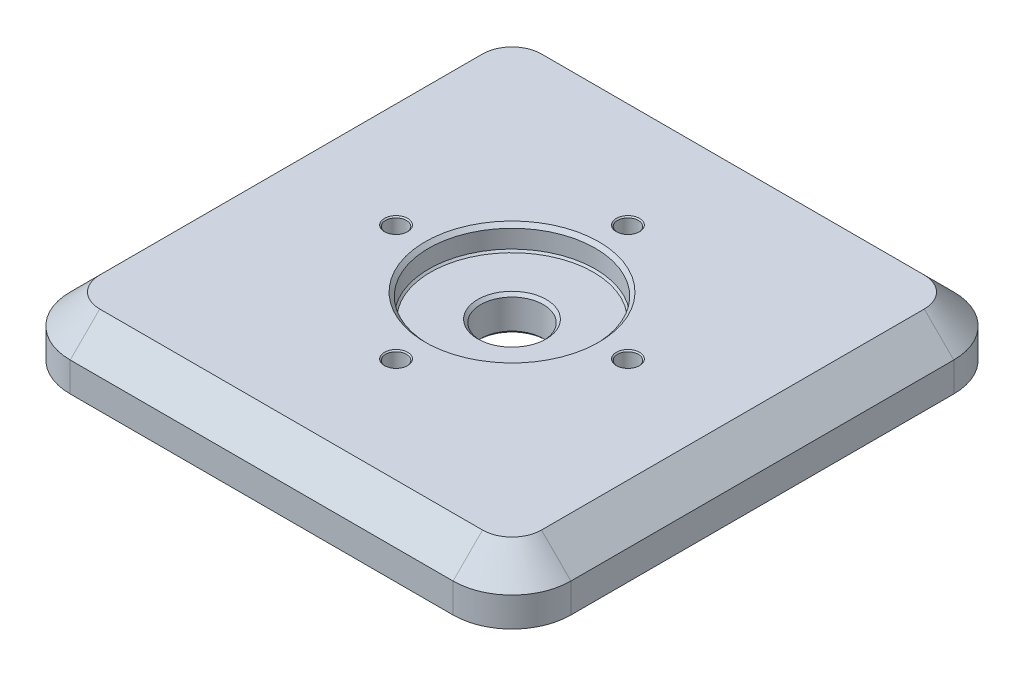
ISO-10303-21;
HEADER;
FILE_DESCRIPTION(('STEP AP214'),'2;1');
FILE_NAME('part.step','',(''),(''),'','','');
FILE_SCHEMA(('AUTOMOTIVE_DESIGN { 1 0 10303 214 1 1 1 1 }'));
ENDSEC;
DATA;
#1=APPLICATION_CONTEXT('core data for automotive mechanical design processes');
#2=APPLICATION_PROTOCOL_DEFINITION('international standard','automotive_design',2000,#1);
#3=PRODUCT_CONTEXT('',#1,'mechanical');
#4=PRODUCT('Part','Part','',(#3));
#5=PRODUCT_RELATED_PRODUCT_CATEGORY('part','',(#4));
#6=PRODUCT_DEFINITION_FORMATION('','',#4);
#7=PRODUCT_DEFINITION_CONTEXT('part definition',#1,'design');
#8=PRODUCT_DEFINITION('design','',#6,#7);
#9=PRODUCT_DEFINITION_SHAPE('','',#8);
#10=(LENGTH_UNIT() NAMED_UNIT(*) SI_UNIT(.MILLI.,.METRE.));
#11=(NAMED_UNIT(*) PLANE_ANGLE_UNIT() SI_UNIT($,.RADIAN.));
#12=(NAMED_UNIT(*) SI_UNIT($,.STERADIAN.) SOLID_ANGLE_UNIT());
#13=UNCERTAINTY_MEASURE_WITH_UNIT(LENGTH_MEASURE(1.E-05),#10,'distance_accuracy_value','');
#14=(GEOMETRIC_REPRESENTATION_CONTEXT(3) GLOBAL_UNCERTAINTY_ASSIGNED_CONTEXT((#13)) GLOBAL_UNIT_ASSIGNED_CONTEXT((#10,
#11,#12)) REPRESENTATION_CONTEXT('',''));
#15=CARTESIAN_POINT('',(0.,0.,0.));
#16=DIRECTION('',(0.,0.,1.));
#17=DIRECTION('',(1.,0.,0.));
#18=AXIS2_PLACEMENT_3D('',#15,#16,#17);
#19=CARTESIAN_POINT('',(0.,96.52,0.));
#20=DIRECTION('',(0.,1.,0.));
#21=DIRECTION('',(0.,0.,1.));
#22=AXIS2_PLACEMENT_3D('',#19,#20,#21);
#23=CONICAL_SURFACE('',#22,17.5609250000001,0.785398163397422);
#24=CARTESIAN_POINT('',(0.,96.9168749999999,0.));
#25=DIRECTION('',(0.,1.,0.));
#26=DIRECTION('',(0.,0.,1.));
#27=AXIS2_PLACEMENT_3D('',#24,#25,#26);
#28=CIRCLE('',#27,17.9578);
#29=CARTESIAN_POINT('',(0.,96.9168749999999,-17.9578));
#30=VERTEX_POINT('',#29);
#31=EDGE_CURVE('E194',#30,#30,#28,.F.);
#32=ORIENTED_EDGE('',*,*,#31,.F.);
#33=EDGE_LOOP('',(#32));
#34=FACE_BOUND('',#33,.T.);
#35=CARTESIAN_POINT('',(0.,96.52,0.));
#36=DIRECTION('',(0.,1.,0.));
#37=DIRECTION('',(0.,0.,1.));
#38=AXIS2_PLACEMENT_3D('',#35,#36,#37);
#39=CIRCLE('',#38,17.5609250000001);
#40=CARTESIAN_POINT('',(0.,96.52,17.5609250000001));
#41=VERTEX_POINT('',#40);
#42=EDGE_CURVE('E191',#41,#41,#39,.T.);
#43=ORIENTED_EDGE('',*,*,#42,.F.);
#44=EDGE_LOOP('',(#43));
#45=FACE_BOUND('',#44,.T.);
#46=ADVANCED_FACE('F47',(#34,#45),#23,.F.);
#47=CARTESIAN_POINT('',(0.,96.52,0.));
#48=DIRECTION('',(0.,1.,0.));
#49=DIRECTION('',(0.,0.,1.));
#50=AXIS2_PLACEMENT_3D('',#47,#48,#49);
#51=PLANE('',#50);
#52=ORIENTED_EDGE('',*,*,#42,.T.);
#53=EDGE_LOOP('',(#52));
#54=FACE_BOUND('',#53,.T.);
#55=CARTESIAN_POINT('',(0.,96.52,0.));
#56=DIRECTION('',(0.,1.,0.));
#57=DIRECTION('',(0.,0.,1.));
#58=AXIS2_PLACEMENT_3D('',#55,#56,#57);
#59=CIRCLE('',#58,7.38124);
#60=CARTESIAN_POINT('',(0.,96.52,7.38124));
#61=VERTEX_POINT('',#60);
#62=EDGE_CURVE('E745',#61,#61,#59,.T.);
#63=ORIENTED_EDGE('',*,*,#62,.F.);
#64=EDGE_LOOP('',(#63));
#65=FACE_BOUND('',#64,.T.);
#66=ADVANCED_FACE('F680',(#54,#65),#51,.T.);
#67=CARTESIAN_POINT('',(0.,96.52,0.));
#68=DIRECTION('',(0.,1.,0.));
#69=DIRECTION('',(0.,0.,1.));
#70=AXIS2_PLACEMENT_3D('',#67,#68,#69);
#71=CONICAL_SURFACE('',#70,7.38124,0.785398163397453);
#72=CARTESIAN_POINT('',(0.,95.885,0.));
#73=DIRECTION('',(0.,1.,0.));
#74=DIRECTION('',(0.,0.,1.));
#75=AXIS2_PLACEMENT_3D('',#72,#73,#74);
#76=CIRCLE('',#75,6.74624);
#77=CARTESIAN_POINT('',(0.,95.885,6.74624));
#78=VERTEX_POINT('',#77);
#79=EDGE_CURVE('E747',#78,#78,#76,.T.);
#80=ORIENTED_EDGE('',*,*,#79,.F.);
#81=EDGE_LOOP('',(#80));
#82=FACE_BOUND('',#81,.T.);
#83=ORIENTED_EDGE('',*,*,#62,.T.);
#84=EDGE_LOOP('',(#83));
#85=FACE_BOUND('',#84,.T.);
#86=ADVANCED_FACE('F671',(#82,#85),#71,.F.);
#87=CARTESIAN_POINT('',(0.,96.52,0.));
#88=DIRECTION('',(0.,1.,0.));
#89=DIRECTION('',(0.,0.,1.));
#90=AXIS2_PLACEMENT_3D('',#87,#88,#89);
#91=CYLINDRICAL_SURFACE('',#90,6.74624);
#92=CARTESIAN_POINT('',(0.,89.535,0.));
#93=DIRECTION('',(0.,1.,0.));
#94=DIRECTION('',(0.,0.,1.));
#95=AXIS2_PLACEMENT_3D('',#92,#93,#94);
#96=CIRCLE('',#95,6.74624);
#97=CARTESIAN_POINT('',(0.,89.535,6.74624));
#98=VERTEX_POINT('',#97);
#99=EDGE_CURVE('E751',#98,#98,#96,.T.);
#100=ORIENTED_EDGE('',*,*,#99,.F.);
#101=EDGE_LOOP('',(#100));
#102=FACE_BOUND('',#101,.T.);
#103=ORIENTED_EDGE('',*,*,#79,.T.);
#104=EDGE_LOOP('',(#103));
#105=FACE_BOUND('',#104,.T.);
#106=ADVANCED_FACE('F661',(#102,#105),#91,.F.);
#107=CARTESIAN_POINT('',(0.,89.535,0.));
#108=DIRECTION('',(0.,-1.,0.));
#109=DIRECTION('',(0.,0.,-1.));
#110=AXIS2_PLACEMENT_3D('',#107,#108,#109);
#111=CONICAL_SURFACE('',#110,6.74624,0.785398163397441);
#112=CARTESIAN_POINT('',(0.,88.9,0.));
#113=DIRECTION('',(0.,1.,0.));
#114=DIRECTION('',(0.,0.,1.));
#115=AXIS2_PLACEMENT_3D('',#112,#113,#114);
#116=CIRCLE('',#115,7.38124);
#117=CARTESIAN_POINT('',(0.,88.9,7.38124));
#118=VERTEX_POINT('',#117);
#119=EDGE_CURVE('E748',#118,#118,#116,.T.);
#120=ORIENTED_EDGE('',*,*,#119,.F.);
#121=EDGE_LOOP('',(#120));
#122=FACE_BOUND('',#121,.T.);
#123=ORIENTED_EDGE('',*,*,#99,.T.);
#124=EDGE_LOOP('',(#123));
#125=FACE_BOUND('',#124,.T.);
#126=ADVANCED_FACE('F654',(#122,#125),#111,.F.);
#127=CARTESIAN_POINT('',(0.,101.600012,0.));
#128=DIRECTION('',(0.,-1.,0.));
#129=DIRECTION('',(0.,0.,-1.));
#130=AXIS2_PLACEMENT_3D('',#127,#128,#129);
#131=CYLINDRICAL_SURFACE('',#130,17.9578);
#132=CARTESIAN_POINT('',(0.,100.80625,0.));
#133=DIRECTION('',(0.,-1.,0.));
#134=DIRECTION('',(0.,0.,-1.));
#135=AXIS2_PLACEMENT_3D('',#132,#133,#134);
#136=CIRCLE('',#135,17.9578);
#137=CARTESIAN_POINT('',(0.,100.80625,-17.9578));
#138=VERTEX_POINT('',#137);
#139=EDGE_CURVE('E184',#138,#138,#136,.F.);
#140=CARTESIAN_POINT('',(0.,96.9168749999999,-17.9578));
#141=CARTESIAN_POINT('',(0.,96.9573893229166,-17.9578));
#142=CARTESIAN_POINT('',(0.,96.9979036458332,-17.9578));
#143=CARTESIAN_POINT('',(0.,97.0789322916666,-17.9578));
#144=CARTESIAN_POINT('',(0.,97.1194466145832,-17.9578));
#145=CARTESIAN_POINT('',(0.,97.2004752604166,-17.9578));
#146=CARTESIAN_POINT('',(0.,97.2409895833332,-17.9578));
#147=CARTESIAN_POINT('',(0.,97.3220182291666,-17.9578));
#148=CARTESIAN_POINT('',(0.,97.3625325520832,-17.9578));
#149=CARTESIAN_POINT('',(0.,97.4435611979166,-17.9578));
#150=CARTESIAN_POINT('',(0.,97.4840755208332,-17.9578));
#151=CARTESIAN_POINT('',(0.,97.5651041666666,-17.9578));
#152=CARTESIAN_POINT('',(0.,97.6056184895832,-17.9578));
#153=CARTESIAN_POINT('',(0.,97.6866471354166,-17.9578));
#154=CARTESIAN_POINT('',(0.,97.7271614583332,-17.9578));
#155=CARTESIAN_POINT('',(0.,97.8081901041666,-17.9578));
#156=CARTESIAN_POINT('',(0.,97.8487044270832,-17.9578));
#157=CARTESIAN_POINT('',(0.,97.9297330729166,-17.9578));
#158=CARTESIAN_POINT('',(0.,97.9702473958332,-17.9578));
#159=CARTESIAN_POINT('',(0.,98.0512760416666,-17.9578));
#160=CARTESIAN_POINT('',(0.,98.0917903645832,-17.9578));
#161=CARTESIAN_POINT('',(0.,98.1728190104166,-17.9578));
#162=CARTESIAN_POINT('',(0.,98.2133333333332,-17.9578));
#163=CARTESIAN_POINT('',(0.,98.2943619791666,-17.9578));
#164=CARTESIAN_POINT('',(0.,98.3348763020832,-17.9578));
#165=CARTESIAN_POINT('',(0.,98.4159049479166,-17.9578));
#166=CARTESIAN_POINT('',(0.,98.4564192708332,-17.9578));
#167=CARTESIAN_POINT('',(0.,98.5374479166666,-17.9578));
#168=CARTESIAN_POINT('',(0.,98.5779622395832,-17.9578));
#169=CARTESIAN_POINT('',(0.,98.6589908854166,-17.9578));
#170=CARTESIAN_POINT('',(0.,98.6995052083332,-17.9578));
#171=CARTESIAN_POINT('',(0.,98.7805338541666,-17.9578));
#172=CARTESIAN_POINT('',(0.,98.8210481770832,-17.9578));
#173=CARTESIAN_POINT('',(0.,98.9020768229166,-17.9578));
#174=CARTESIAN_POINT('',(0.,98.9425911458332,-17.9578));
#175=CARTESIAN_POINT('',(0.,99.0236197916666,-17.9578));
#176=CARTESIAN_POINT('',(0.,99.0641341145832,-17.9578));
#177=CARTESIAN_POINT('',(0.,99.1451627604166,-17.9578));
#178=CARTESIAN_POINT('',(0.,99.1856770833332,-17.9578));
#179=CARTESIAN_POINT('',(0.,99.2667057291666,-17.9578));
#180=CARTESIAN_POINT('',(0.,99.3072200520832,-17.9578));
#181=CARTESIAN_POINT('',(0.,99.3882486979166,-17.9578));
#182=CARTESIAN_POINT('',(0.,99.4287630208332,-17.9578));
#183=CARTESIAN_POINT('',(0.,99.5097916666666,-17.9578));
#184=CARTESIAN_POINT('',(0.,99.5503059895832,-17.9578));
#185=CARTESIAN_POINT('',(0.,99.6313346354166,-17.9578));
#186=CARTESIAN_POINT('',(0.,99.6718489583332,-17.9578));
#187=CARTESIAN_POINT('',(0.,99.7528776041666,-17.9578));
#188=CARTESIAN_POINT('',(0.,99.7933919270832,-17.9578));
#189=CARTESIAN_POINT('',(0.,99.8744205729165,-17.9578));
#190=CARTESIAN_POINT('',(0.,99.9149348958332,-17.9578));
#191=CARTESIAN_POINT('',(0.,99.9959635416666,-17.9578));
#192=CARTESIAN_POINT('',(0.,100.036477864583,-17.9578));
#193=CARTESIAN_POINT('',(0.,100.117506510417,-17.9578));
#194=CARTESIAN_POINT('',(0.,100.158020833333,-17.9578));
#195=CARTESIAN_POINT('',(0.,100.239049479167,-17.9578));
#196=CARTESIAN_POINT('',(0.,100.279563802083,-17.9578));
#197=CARTESIAN_POINT('',(0.,100.360592447917,-17.9578));
#198=CARTESIAN_POINT('',(0.,100.401106770833,-17.9578));
#199=CARTESIAN_POINT('',(0.,100.482135416667,-17.9578));
#200=CARTESIAN_POINT('',(0.,100.522649739583,-17.9578));
#201=CARTESIAN_POINT('',(0.,100.603678385417,-17.9578));
#202=CARTESIAN_POINT('',(0.,100.644192708333,-17.9578));
#203=CARTESIAN_POINT('',(0.,100.725221354167,-17.9578));
#204=CARTESIAN_POINT('',(0.,100.765735677083,-17.9578));
#205=CARTESIAN_POINT('',(0.,100.80625,-17.9578));
#206=B_SPLINE_CURVE_WITH_KNOTS('',3,(#140,#141,#142,#143,#144,#145,#146,#147,#148,#149,#150,
#151,#152,#153,#154,#155,#156,#157,#158,#159,#160,#161,#162,#163,#164,#165,#166,#167,#168,#169,
#170,#171,#172,#173,#174,#175,#176,#177,#178,#179,#180,#181,#182,#183,#184,#185,#186,#187,#188,
#189,#190,#191,#192,#193,#194,#195,#196,#197,#198,#199,#200,#201,#202,#203,#204,#205),
.UNSPECIFIED.,.F.,.F.,(4,2,2,2,2,2,2,2,2,2,2,2,2,2,2,2,2,2,2,2,2,2,2,2,2,2,2,2,2,2,2,2,4),(0.,
0.121542968749999,0.243085937499998,0.364628906249997,0.486171874999997,0.607714843749996,
0.729257812499995,0.850800781249994,0.972343749999993,1.09388671874999,1.21542968749999,
1.33697265624999,1.45851562499999,1.58005859374999,1.70160156249999,1.82314453124999,
1.94468749999997,2.06623046874997,2.18777343749997,2.30931640624997,2.43085937499997,
2.55240234374997,2.67394531249997,2.79548828124997,2.91703124999997,3.03857421874996,
3.16011718749996,3.28166015624996,3.40320312499996,3.52474609374996,3.64628906249996,
3.76783203124996,3.88937499999996),.UNSPECIFIED.);
#207=EDGE_CURVE('BSEAM645',#30,#138,#206,.T.);
#208=ORIENTED_EDGE('',*,*,#31,.T.);
#209=ORIENTED_EDGE('',*,*,#139,.T.);
#210=ORIENTED_EDGE('',*,*,#207,.T.);
#211=ORIENTED_EDGE('',*,*,#207,.F.);
#212=EDGE_LOOP('',(#208,#210,#209,#211));
#213=FACE_BOUND('',#212,.T.);
#214=ADVANCED_FACE('F645',(#213),#131,.F.);
#215=CARTESIAN_POINT('',(25.,101.346,0.));
#216=DIRECTION('',(0.,1.,0.));
#217=DIRECTION('',(0.,0.,1.));
#218=AXIS2_PLACEMENT_3D('',#215,#216,#217);
#219=CONICAL_SURFACE('',#218,2.2479,0.785398163397442);
#220=CARTESIAN_POINT('',(25.,101.6,0.));
#221=DIRECTION('',(0.,-1.,0.));
#222=DIRECTION('',(0.,0.,-1.));
#223=AXIS2_PLACEMENT_3D('',#220,#221,#222);
#224=CIRCLE('',#223,2.5019);
#225=CARTESIAN_POINT('',(25.,101.6,-2.5019));
#226=VERTEX_POINT('',#225);
#227=EDGE_CURVE('E772',#226,#226,#224,.T.);
#228=ORIENTED_EDGE('',*,*,#227,.F.);
#229=EDGE_LOOP('',(#228));
#230=FACE_BOUND('',#229,.T.);
#231=CARTESIAN_POINT('',(25.,101.346,0.));
#232=DIRECTION('',(0.,-1.,0.));
#233=DIRECTION('',(0.,0.,-1.));
#234=AXIS2_PLACEMENT_3D('',#231,#232,#233);
#235=CIRCLE('',#234,2.2479);
#236=CARTESIAN_POINT('',(25.,101.346,-2.2479));
#237=VERTEX_POINT('',#236);
#238=EDGE_CURVE('E754',#237,#237,#235,.T.);
#239=ORIENTED_EDGE('',*,*,#238,.T.);
#240=EDGE_LOOP('',(#239));
#241=FACE_BOUND('',#240,.T.);
#242=ADVANCED_FACE('F636',(#230,#241),#219,.F.);
#243=CARTESIAN_POINT('',(25.,88.9,0.));
#244=DIRECTION('',(0.,-1.,0.));
#245=DIRECTION('',(0.,0.,-1.));
#246=AXIS2_PLACEMENT_3D('',#243,#244,#245);
#247=CYLINDRICAL_SURFACE('',#246,2.2479);
#248=ORIENTED_EDGE('',*,*,#238,.F.);
#249=EDGE_LOOP('',(#248));
#250=FACE_BOUND('',#249,.T.);
#251=CARTESIAN_POINT('',(25.,89.535,0.));
#252=DIRECTION('',(0.,-1.,0.));
#253=DIRECTION('',(0.,0.,-1.));
#254=AXIS2_PLACEMENT_3D('',#251,#252,#253);
#255=CIRCLE('',#254,2.2479);
#256=CARTESIAN_POINT('',(25.,89.535,-2.2479));
#257=VERTEX_POINT('',#256);
#258=EDGE_CURVE('E766',#257,#257,#255,.T.);
#259=ORIENTED_EDGE('',*,*,#258,.T.);
#260=EDGE_LOOP('',(#259));
#261=FACE_BOUND('',#260,.T.);
#262=ADVANCED_FACE('F625',(#250,#261),#247,.F.);
#263=CARTESIAN_POINT('',(25.,88.9,0.));
#264=DIRECTION('',(0.,-1.,0.));
#265=DIRECTION('',(0.,0.,-1.));
#266=AXIS2_PLACEMENT_3D('',#263,#264,#265);
#267=CONICAL_SURFACE('',#266,2.8829,0.785398163397454);
#268=ORIENTED_EDGE('',*,*,#258,.F.);
#269=EDGE_LOOP('',(#268));
#270=FACE_BOUND('',#269,.T.);
#271=CARTESIAN_POINT('',(25.,88.9,0.));
#272=DIRECTION('',(0.,-1.,0.));
#273=DIRECTION('',(0.,0.,-1.));
#274=AXIS2_PLACEMENT_3D('',#271,#272,#273);
#275=CIRCLE('',#274,2.8829);
#276=CARTESIAN_POINT('',(25.,88.9,-2.8829));
#277=VERTEX_POINT('',#276);
#278=EDGE_CURVE('E769',#277,#277,#275,.T.);
#279=ORIENTED_EDGE('',*,*,#278,.T.);
#280=EDGE_LOOP('',(#279));
#281=FACE_BOUND('',#280,.T.);
#282=ADVANCED_FACE('F616',(#270,#281),#267,.F.);
#283=CARTESIAN_POINT('',(2.61861100413235E-13,101.346,-25.));
#284=DIRECTION('',(0.,1.,0.));
#285=DIRECTION('',(1.,0.,0.));
#286=AXIS2_PLACEMENT_3D('',#283,#284,#285);
#287=CONICAL_SURFACE('',#286,2.2479,0.785398163397442);
#288=CARTESIAN_POINT('',(2.61861100413235E-13,101.6,-25.));
#289=DIRECTION('',(0.,-1.,0.));
#290=DIRECTION('',(-1.,0.,0.));
#291=AXIS2_PLACEMENT_3D('',#288,#289,#290);
#292=CIRCLE('',#291,2.5019);
#293=CARTESIAN_POINT('',(-2.50189999999974,101.6,-25.));
#294=VERTEX_POINT('',#293);
#295=EDGE_CURVE('E783',#294,#294,#292,.T.);
#296=ORIENTED_EDGE('',*,*,#295,.F.);
#297=EDGE_LOOP('',(#296));
#298=FACE_BOUND('',#297,.T.);
#299=CARTESIAN_POINT('',(2.61861100413235E-13,101.346,-25.));
#300=DIRECTION('',(0.,-1.,0.));
#301=DIRECTION('',(-1.,0.,0.));
#302=AXIS2_PLACEMENT_3D('',#299,#300,#301);
#303=CIRCLE('',#302,2.2479);
#304=CARTESIAN_POINT('',(-2.24789999999974,101.346,-25.));
#305=VERTEX_POINT('',#304);
#306=EDGE_CURVE('E776',#305,#305,#303,.T.);
#307=ORIENTED_EDGE('',*,*,#306,.T.);
#308=EDGE_LOOP('',(#307));
#309=FACE_BOUND('',#308,.T.);
#310=ADVANCED_FACE('F607',(#298,#309),#287,.F.);
#311=CARTESIAN_POINT('',(2.61861100413235E-13,88.9,-25.));
#312=DIRECTION('',(0.,-1.,0.));
#313=DIRECTION('',(-1.,0.,0.));
#314=AXIS2_PLACEMENT_3D('',#311,#312,#313);
#315=CYLINDRICAL_SURFACE('',#314,2.2479);
#316=ORIENTED_EDGE('',*,*,#306,.F.);
#317=EDGE_LOOP('',(#316));
#318=FACE_BOUND('',#317,.T.);
#319=CARTESIAN_POINT('',(2.61861100413235E-13,89.535,-25.));
#320=DIRECTION('',(0.,-1.,0.));
#321=DIRECTION('',(-1.,0.,0.));
#322=AXIS2_PLACEMENT_3D('',#319,#320,#321);
#323=CIRCLE('',#322,2.2479);
#324=CARTESIAN_POINT('',(-2.24789999999974,89.535,-25.));
#325=VERTEX_POINT('',#324);
#326=EDGE_CURVE('E780',#325,#325,#323,.T.);
#327=ORIENTED_EDGE('',*,*,#326,.T.);
#328=EDGE_LOOP('',(#327));
#329=FACE_BOUND('',#328,.T.);
#330=ADVANCED_FACE('F596',(#318,#329),#315,.F.);
#331=CARTESIAN_POINT('',(2.61861100413235E-13,88.9,-25.));
#332=DIRECTION('',(0.,-1.,0.));
#333=DIRECTION('',(-1.,0.,0.));
#334=AXIS2_PLACEMENT_3D('',#331,#332,#333);
#335=CONICAL_SURFACE('',#334,2.8829,0.785398163397454);
#336=ORIENTED_EDGE('',*,*,#326,.F.);
#337=EDGE_LOOP('',(#336));
#338=FACE_BOUND('',#337,.T.);
#339=CARTESIAN_POINT('',(2.61861100413235E-13,88.9,-25.));
#340=DIRECTION('',(0.,-1.,0.));
#341=DIRECTION('',(-1.,0.,0.));
#342=AXIS2_PLACEMENT_3D('',#339,#340,#341);
#343=CIRCLE('',#342,2.8829);
#344=CARTESIAN_POINT('',(-2.88289999999974,88.9,-25.));
#345=VERTEX_POINT('',#344);
#346=EDGE_CURVE('E183',#345,#345,#343,.T.);
#347=ORIENTED_EDGE('',*,*,#346,.T.);
#348=EDGE_LOOP('',(#347));
#349=FACE_BOUND('',#348,.T.);
#350=ADVANCED_FACE('F587',(#338,#349),#335,.F.);
#351=CARTESIAN_POINT('',(-25.,101.346,0.));
#352=DIRECTION('',(0.,1.,0.));
#353=DIRECTION('',(0.,0.,-1.));
#354=AXIS2_PLACEMENT_3D('',#351,#352,#353);
#355=CONICAL_SURFACE('',#354,2.2479,0.785398163397442);
#356=CARTESIAN_POINT('',(-25.,101.6,0.));
#357=DIRECTION('',(0.,-1.,0.));
#358=DIRECTION('',(0.,0.,1.));
#359=AXIS2_PLACEMENT_3D('',#356,#357,#358);
#360=CIRCLE('',#359,2.5019);
#361=CARTESIAN_POINT('',(-25.,101.6,2.5019));
#362=VERTEX_POINT('',#361);
#363=EDGE_CURVE('E795',#362,#362,#360,.T.);
#364=ORIENTED_EDGE('',*,*,#363,.F.);
#365=EDGE_LOOP('',(#364));
#366=FACE_BOUND('',#365,.T.);
#367=CARTESIAN_POINT('',(-25.,101.346,0.));
#368=DIRECTION('',(0.,-1.,0.));
#369=DIRECTION('',(0.,0.,1.));
#370=AXIS2_PLACEMENT_3D('',#367,#368,#369);
#371=CIRCLE('',#370,2.2479);
#372=CARTESIAN_POINT('',(-25.,101.346,2.2479));
#373=VERTEX_POINT('',#372);
#374=EDGE_CURVE('E788',#373,#373,#371,.T.);
#375=ORIENTED_EDGE('',*,*,#374,.T.);
#376=EDGE_LOOP('',(#375));
#377=FACE_BOUND('',#376,.T.);
#378=ADVANCED_FACE('F578',(#366,#377),#355,.F.);
#379=CARTESIAN_POINT('',(-25.,88.9,0.));
#380=DIRECTION('',(0.,-1.,0.));
#381=DIRECTION('',(0.,0.,1.));
#382=AXIS2_PLACEMENT_3D('',#379,#380,#381);
#383=CYLINDRICAL_SURFACE('',#382,2.2479);
#384=ORIENTED_EDGE('',*,*,#374,.F.);
#385=EDGE_LOOP('',(#384));
#386=FACE_BOUND('',#385,.T.);
#387=CARTESIAN_POINT('',(-25.,89.535,0.));
#388=DIRECTION('',(0.,-1.,0.));
#389=DIRECTION('',(0.,0.,1.));
#390=AXIS2_PLACEMENT_3D('',#387,#388,#389);
#391=CIRCLE('',#390,2.2479);
#392=CARTESIAN_POINT('',(-25.,89.535,2.2479));
#393=VERTEX_POINT('',#392);
#394=EDGE_CURVE('E792',#393,#393,#391,.T.);
#395=ORIENTED_EDGE('',*,*,#394,.T.);
#396=EDGE_LOOP('',(#395));
#397=FACE_BOUND('',#396,.T.);
#398=ADVANCED_FACE('F568',(#386,#397),#383,.F.);
#399=CARTESIAN_POINT('',(-25.,88.9,0.));
#400=DIRECTION('',(0.,-1.,0.));
#401=DIRECTION('',(0.,0.,1.));
#402=AXIS2_PLACEMENT_3D('',#399,#400,#401);
#403=CONICAL_SURFACE('',#402,2.8829,0.785398163397454);
#404=ORIENTED_EDGE('',*,*,#394,.F.);
#405=EDGE_LOOP('',(#404));
#406=FACE_BOUND('',#405,.T.);
#407=CARTESIAN_POINT('',(-25.,88.9,0.));
#408=DIRECTION('',(0.,-1.,0.));
#409=DIRECTION('',(0.,0.,1.));
#410=AXIS2_PLACEMENT_3D('',#407,#408,#409);
#411=CIRCLE('',#410,2.8829);
#412=CARTESIAN_POINT('',(-25.,88.9,2.8829));
#413=VERTEX_POINT('',#412);
#414=EDGE_CURVE('E779',#413,#413,#411,.T.);
#415=ORIENTED_EDGE('',*,*,#414,.T.);
#416=EDGE_LOOP('',(#415));
#417=FACE_BOUND('',#416,.T.);
#418=ADVANCED_FACE('F559',(#406,#417),#403,.F.);
#419=CARTESIAN_POINT('',(0.,101.346,25.));
#420=DIRECTION('',(0.,1.,0.));
#421=DIRECTION('',(-1.,0.,0.));
#422=AXIS2_PLACEMENT_3D('',#419,#420,#421);
#423=CONICAL_SURFACE('',#422,2.2479,0.785398163397442);
#424=CARTESIAN_POINT('',(0.,101.6,25.));
#425=DIRECTION('',(0.,-1.,0.));
#426=DIRECTION('',(1.,0.,0.));
#427=AXIS2_PLACEMENT_3D('',#424,#425,#426);
#428=CIRCLE('',#427,2.5019);
#429=CARTESIAN_POINT('',(2.50189999999991,101.6,25.));
#430=VERTEX_POINT('',#429);
#431=EDGE_CURVE('E805',#430,#430,#428,.T.);
#432=ORIENTED_EDGE('',*,*,#431,.F.);
#433=EDGE_LOOP('',(#432));
#434=FACE_BOUND('',#433,.T.);
#435=CARTESIAN_POINT('',(0.,101.346,25.));
#436=DIRECTION('',(0.,-1.,0.));
#437=DIRECTION('',(1.,0.,0.));
#438=AXIS2_PLACEMENT_3D('',#435,#436,#437);
#439=CIRCLE('',#438,2.2479);
#440=CARTESIAN_POINT('',(2.24789999999991,101.346,25.));
#441=VERTEX_POINT('',#440);
#442=EDGE_CURVE('E775',#441,#441,#439,.T.);
#443=ORIENTED_EDGE('',*,*,#442,.T.);
#444=EDGE_LOOP('',(#443));
#445=FACE_BOUND('',#444,.T.);
#446=ADVANCED_FACE('F551',(#434,#445),#423,.F.);
#447=CARTESIAN_POINT('',(0.,88.9,25.));
#448=DIRECTION('',(0.,-1.,0.));
#449=DIRECTION('',(1.,0.,0.));
#450=AXIS2_PLACEMENT_3D('',#447,#448,#449);
#451=CYLINDRICAL_SURFACE('',#450,2.2479);
#452=ORIENTED_EDGE('',*,*,#442,.F.);
#453=EDGE_LOOP('',(#452));
#454=FACE_BOUND('',#453,.T.);
#455=CARTESIAN_POINT('',(0.,89.535,25.));
#456=DIRECTION('',(0.,-1.,0.));
#457=DIRECTION('',(1.,0.,0.));
#458=AXIS2_PLACEMENT_3D('',#455,#456,#457);
#459=CIRCLE('',#458,2.2479);
#460=CARTESIAN_POINT('',(2.24789999999991,89.535,25.));
#461=VERTEX_POINT('',#460);
#462=EDGE_CURVE('E802',#461,#461,#459,.T.);
#463=ORIENTED_EDGE('',*,*,#462,.T.);
#464=EDGE_LOOP('',(#463));
#465=FACE_BOUND('',#464,.T.);
#466=ADVANCED_FACE('F541',(#454,#465),#451,.F.);
#467=CARTESIAN_POINT('',(0.,88.9,25.));
#468=DIRECTION('',(0.,-1.,0.));
#469=DIRECTION('',(1.,0.,0.));
#470=AXIS2_PLACEMENT_3D('',#467,#468,#469);
#471=CONICAL_SURFACE('',#470,2.8829,0.785398163397454);
#472=ORIENTED_EDGE('',*,*,#462,.F.);
#473=EDGE_LOOP('',(#472));
#474=FACE_BOUND('',#473,.T.);
#475=CARTESIAN_POINT('',(0.,88.9,25.));
#476=DIRECTION('',(0.,-1.,0.));
#477=DIRECTION('',(1.,0.,0.));
#478=AXIS2_PLACEMENT_3D('',#475,#476,#477);
#479=CIRCLE('',#478,2.8829);
#480=CARTESIAN_POINT('',(2.88289999999991,88.9,25.));
#481=VERTEX_POINT('',#480);
#482=EDGE_CURVE('E791',#481,#481,#479,.T.);
#483=ORIENTED_EDGE('',*,*,#482,.T.);
#484=EDGE_LOOP('',(#483));
#485=FACE_BOUND('',#484,.T.);
#486=ADVANCED_FACE('F532',(#474,#485),#471,.F.);
#487=CARTESIAN_POINT('',(0.,100.80625,0.));
#488=DIRECTION('',(0.,1.,0.));
#489=DIRECTION('',(0.,0.,1.));
#490=AXIS2_PLACEMENT_3D('',#487,#488,#489);
#491=CONICAL_SURFACE('',#490,17.9578,0.785398163397437);
#492=CARTESIAN_POINT('',(0.,101.6,0.));
#493=DIRECTION('',(0.,-1.,0.));
#494=DIRECTION('',(0.,0.,-1.));
#495=AXIS2_PLACEMENT_3D('',#492,#493,#494);
#496=CIRCLE('',#495,18.7515500000001);
#497=CARTESIAN_POINT('',(0.,101.6,-18.7515500000001));
#498=VERTEX_POINT('',#497);
#499=EDGE_CURVE('E187',#498,#498,#496,.T.);
#500=ORIENTED_EDGE('',*,*,#499,.F.);
#501=EDGE_LOOP('',(#500));
#502=FACE_BOUND('',#501,.T.);
#503=ORIENTED_EDGE('',*,*,#139,.F.);
#504=EDGE_LOOP('',(#503));
#505=FACE_BOUND('',#504,.T.);
#506=ADVANCED_FACE('F508',(#502,#505),#491,.F.);
#507=CARTESIAN_POINT('',(0.,101.6,0.));
#508=DIRECTION('',(0.,-1.,0.));
#509=DIRECTION('',(0.,0.,-1.));
#510=AXIS2_PLACEMENT_3D('',#507,#508,#509);
#511=PLANE('',#510);
#512=ORIENTED_EDGE('',*,*,#499,.T.);
#513=EDGE_LOOP('',(#512));
#514=FACE_BOUND('',#513,.T.);
#515=DIRECTION('',(-1.,0.,0.));
#516=VECTOR('',#515,1.);
#517=CARTESIAN_POINT('',(-41.275,101.6,-47.6249999999999));
#518=LINE('',#517,#516);
#519=CARTESIAN_POINT('',(41.275,101.6,-47.6249999999999));
#520=VERTEX_POINT('',#519);
#521=CARTESIAN_POINT('',(-41.275,101.6,-47.6249999999999));
#522=VERTEX_POINT('',#521);
#523=EDGE_CURVE('E238',#520,#522,#518,.T.);
#524=ORIENTED_EDGE('',*,*,#523,.T.);
#525=CARTESIAN_POINT('',(-41.275,101.6,-41.275));
#526=DIRECTION('',(0.,-1.,0.));
#527=DIRECTION('',(0.,0.,-1.));
#528=AXIS2_PLACEMENT_3D('',#525,#526,#527);
#529=CIRCLE('',#528,6.34999999999995);
#530=CARTESIAN_POINT('',(-47.625,101.6,-41.275));
#531=VERTEX_POINT('',#530);
#532=EDGE_CURVE('E241',#522,#531,#529,.F.);
#533=ORIENTED_EDGE('',*,*,#532,.T.);
#534=DIRECTION('',(0.,0.,1.));
#535=VECTOR('',#534,1.);
#536=CARTESIAN_POINT('',(-47.625,101.6,41.275));
#537=LINE('',#536,#535);
#538=CARTESIAN_POINT('',(-47.6249999999999,101.6,41.275));
#539=VERTEX_POINT('',#538);
#540=EDGE_CURVE('E144',#531,#539,#537,.T.);
#541=ORIENTED_EDGE('',*,*,#540,.T.);
#542=CARTESIAN_POINT('',(-41.275,101.6,41.275));
#543=DIRECTION('',(0.,-1.,0.));
#544=DIRECTION('',(0.,0.,-1.));
#545=AXIS2_PLACEMENT_3D('',#542,#543,#544);
#546=CIRCLE('',#545,6.34999999999995);
#547=CARTESIAN_POINT('',(-41.275,101.6,47.6249999999999));
#548=VERTEX_POINT('',#547);
#549=EDGE_CURVE('E137',#539,#548,#546,.F.);
#550=ORIENTED_EDGE('',*,*,#549,.T.);
#551=DIRECTION('',(1.,0.,0.));
#552=VECTOR('',#551,1.);
#553=CARTESIAN_POINT('',(0.,101.6,47.6249999999999));
#554=LINE('',#553,#552);
#555=CARTESIAN_POINT('',(41.275,101.6,47.6249999999999));
#556=VERTEX_POINT('',#555);
#557=EDGE_CURVE('E141',#548,#556,#554,.T.);
#558=ORIENTED_EDGE('',*,*,#557,.T.);
#559=CARTESIAN_POINT('',(41.275,101.6,41.275));
#560=DIRECTION('',(0.,-1.,0.));
#561=DIRECTION('',(0.,0.,-1.));
#562=AXIS2_PLACEMENT_3D('',#559,#560,#561);
#563=CIRCLE('',#562,6.34999999999995);
#564=CARTESIAN_POINT('',(47.625,101.6,41.275));
#565=VERTEX_POINT('',#564);
#566=EDGE_CURVE('E148',#556,#565,#563,.F.);
#567=ORIENTED_EDGE('',*,*,#566,.T.);
#568=DIRECTION('',(0.,0.,-1.));
#569=VECTOR('',#568,1.);
#570=CARTESIAN_POINT('',(47.625,101.6,0.));
#571=LINE('',#570,#569);
#572=CARTESIAN_POINT('',(47.625,101.6,-41.275));
#573=VERTEX_POINT('',#572);
#574=EDGE_CURVE('E234',#565,#573,#571,.T.);
#575=ORIENTED_EDGE('',*,*,#574,.T.);
#576=CARTESIAN_POINT('',(41.275,101.6,-41.275));
#577=DIRECTION('',(0.,-1.,0.));
#578=DIRECTION('',(0.,0.,-1.));
#579=AXIS2_PLACEMENT_3D('',#576,#577,#578);
#580=CIRCLE('',#579,6.34999999999995);
#581=EDGE_CURVE('E236',#573,#520,#580,.F.);
#582=ORIENTED_EDGE('',*,*,#581,.T.);
#583=EDGE_LOOP('',(#524,#533,#541,#550,#558,#567,#575,#582));
#584=FACE_BOUND('',#583,.T.);
#585=ORIENTED_EDGE('',*,*,#431,.T.);
#586=EDGE_LOOP('',(#585));
#587=FACE_BOUND('',#586,.T.);
#588=ORIENTED_EDGE('',*,*,#363,.T.);
#589=EDGE_LOOP('',(#588));
#590=FACE_BOUND('',#589,.T.);
#591=ORIENTED_EDGE('',*,*,#295,.T.);
#592=EDGE_LOOP('',(#591));
#593=FACE_BOUND('',#592,.T.);
#594=ORIENTED_EDGE('',*,*,#227,.T.);
#595=EDGE_LOOP('',(#594));
#596=FACE_BOUND('',#595,.T.);
#597=ADVANCED_FACE('F139',(#514,#584,#587,#590,#593,#596),#511,.F.);
#598=CARTESIAN_POINT('',(53.975,95.25,0.));
#599=DIRECTION('',(-0.707106781186544,-0.707106781186551,0.));
#600=DIRECTION('',(0.,0.,1.));
#601=AXIS2_PLACEMENT_3D('',#598,#599,#600);
#602=PLANE('',#601);
#603=DIRECTION('',(-0.707106781186551,0.707106781186544,0.));
#604=VECTOR('',#603,1.);
#605=CARTESIAN_POINT('',(53.975,95.25,41.275));
#606=LINE('',#605,#604);
#607=CARTESIAN_POINT('',(53.975,95.25,41.275));
#608=VERTEX_POINT('',#607);
#609=EDGE_CURVE('E177',#608,#565,#606,.T.);
#610=ORIENTED_EDGE('',*,*,#609,.F.);
#611=DIRECTION('',(0.,0.,1.));
#612=VECTOR('',#611,1.);
#613=CARTESIAN_POINT('',(53.975,95.25,0.));
#614=LINE('',#613,#612);
#615=CARTESIAN_POINT('',(53.975,95.25,-41.275));
#616=VERTEX_POINT('',#615);
#617=EDGE_CURVE('E252',#616,#608,#614,.T.);
#618=ORIENTED_EDGE('',*,*,#617,.F.);
#619=DIRECTION('',(0.707106781186551,-0.707106781186544,0.));
#620=VECTOR('',#619,1.);
#621=CARTESIAN_POINT('',(47.625,101.6,-41.275));
#622=LINE('',#621,#620);
#623=EDGE_CURVE('E180',#573,#616,#622,.T.);
#624=ORIENTED_EDGE('',*,*,#623,.F.);
#625=ORIENTED_EDGE('',*,*,#574,.F.);
#626=EDGE_LOOP('',(#610,#618,#624,#625));
#627=FACE_BOUND('',#626,.T.);
#628=ADVANCED_FACE('F294',(#627),#602,.F.);
#629=CARTESIAN_POINT('',(-47.625,101.6,0.));
#630=DIRECTION('',(-0.707106781186547,0.707106781186547,0.));
#631=DIRECTION('',(0.,0.,-1.));
#632=AXIS2_PLACEMENT_3D('',#629,#630,#631);
#633=PLANE('',#632);
#634=DIRECTION('',(-0.707106781186551,-0.707106781186544,0.));
#635=VECTOR('',#634,1.);
#636=CARTESIAN_POINT('',(-47.6249999999999,101.6,-41.275));
#637=LINE('',#636,#635);
#638=CARTESIAN_POINT('',(-53.975,95.25,-41.275));
#639=VERTEX_POINT('',#638);
#640=EDGE_CURVE('E165',#531,#639,#637,.T.);
#641=ORIENTED_EDGE('',*,*,#640,.T.);
#642=DIRECTION('',(0.,0.,-1.));
#643=VECTOR('',#642,1.);
#644=CARTESIAN_POINT('',(-53.975,95.25,-41.275));
#645=LINE('',#644,#643);
#646=CARTESIAN_POINT('',(-53.975,95.25,41.275));
#647=VERTEX_POINT('',#646);
#648=EDGE_CURVE('E243',#647,#639,#645,.T.);
#649=ORIENTED_EDGE('',*,*,#648,.F.);
#650=DIRECTION('',(0.707106781186551,0.707106781186544,0.));
#651=VECTOR('',#650,1.);
#652=CARTESIAN_POINT('',(-53.975,95.25,41.275));
#653=LINE('',#652,#651);
#654=EDGE_CURVE('E169',#647,#539,#653,.T.);
#655=ORIENTED_EDGE('',*,*,#654,.T.);
#656=ORIENTED_EDGE('',*,*,#540,.F.);
#657=EDGE_LOOP('',(#641,#649,#655,#656));
#658=FACE_BOUND('',#657,.T.);
#659=ADVANCED_FACE('F260',(#658),#633,.T.);
#660=CARTESIAN_POINT('',(0.,101.6,-47.6249999999999));
#661=DIRECTION('',(0.,0.707106781186551,-0.707106781186544));
#662=DIRECTION('',(1.,0.,0.));
#663=AXIS2_PLACEMENT_3D('',#660,#661,#662);
#664=PLANE('',#663);
#665=DIRECTION('',(0.,-0.707106781186544,-0.707106781186551));
#666=VECTOR('',#665,1.);
#667=CARTESIAN_POINT('',(41.275,101.6,-47.6249999999999));
#668=LINE('',#667,#666);
#669=CARTESIAN_POINT('',(41.275,95.25,-53.975));
#670=VERTEX_POINT('',#669);
#671=EDGE_CURVE('E174',#520,#670,#668,.T.);
#672=ORIENTED_EDGE('',*,*,#671,.T.);
#673=DIRECTION('',(1.,0.,0.));
#674=VECTOR('',#673,1.);
#675=CARTESIAN_POINT('',(41.275,95.25,-53.975));
#676=LINE('',#675,#674);
#677=CARTESIAN_POINT('',(-41.275,95.25,-53.975));
#678=VERTEX_POINT('',#677);
#679=EDGE_CURVE('E246',#678,#670,#676,.T.);
#680=ORIENTED_EDGE('',*,*,#679,.F.);
#681=DIRECTION('',(0.,-0.707106781186544,-0.707106781186551));
#682=VECTOR('',#681,1.);
#683=CARTESIAN_POINT('',(-41.275,101.6,-47.6249999999999));
#684=LINE('',#683,#682);
#685=EDGE_CURVE('E164',#522,#678,#684,.T.);
#686=ORIENTED_EDGE('',*,*,#685,.F.);
#687=ORIENTED_EDGE('',*,*,#523,.F.);
#688=EDGE_LOOP('',(#672,#680,#686,#687));
#689=FACE_BOUND('',#688,.T.);
#690=ADVANCED_FACE('F303',(#689),#664,.T.);
#691=CARTESIAN_POINT('',(0.,95.25,53.975));
#692=DIRECTION('',(0.,-0.707106781186551,-0.707106781186544));
#693=DIRECTION('',(-1.,0.,0.));
#694=AXIS2_PLACEMENT_3D('',#691,#692,#693);
#695=PLANE('',#694);
#696=DIRECTION('',(0.,0.707106781186544,-0.707106781186551));
#697=VECTOR('',#696,1.);
#698=CARTESIAN_POINT('',(41.275,95.25,53.975));
#699=LINE('',#698,#697);
#700=CARTESIAN_POINT('',(41.275,95.25,53.975));
#701=VERTEX_POINT('',#700);
#702=EDGE_CURVE('E158',#701,#556,#699,.T.);
#703=ORIENTED_EDGE('',*,*,#702,.T.);
#704=ORIENTED_EDGE('',*,*,#557,.F.);
#705=DIRECTION('',(0.,0.707106781186544,-0.707106781186551));
#706=VECTOR('',#705,1.);
#707=CARTESIAN_POINT('',(-41.275,95.25,53.975));
#708=LINE('',#707,#706);
#709=CARTESIAN_POINT('',(-41.275,95.25,53.975));
#710=VERTEX_POINT('',#709);
#711=EDGE_CURVE('E155',#710,#548,#708,.T.);
#712=ORIENTED_EDGE('',*,*,#711,.F.);
#713=DIRECTION('',(-1.,0.,0.));
#714=VECTOR('',#713,1.);
#715=CARTESIAN_POINT('',(0.,95.25,53.975));
#716=LINE('',#715,#714);
#717=EDGE_CURVE('E188',#701,#710,#716,.T.);
#718=ORIENTED_EDGE('',*,*,#717,.F.);
#719=EDGE_LOOP('',(#703,#704,#712,#718));
#720=FACE_BOUND('',#719,.T.);
#721=ADVANCED_FACE('F153',(#720),#695,.F.);
#722=CARTESIAN_POINT('',(-41.275,101.6,-41.275));
#723=DIRECTION('',(0.,-1.,0.));
#724=DIRECTION('',(0.,0.,-1.));
#725=AXIS2_PLACEMENT_3D('',#722,#723,#724);
#726=CONICAL_SURFACE('',#725,6.34999999999995,0.785398163397453);
#727=ORIENTED_EDGE('',*,*,#685,.T.);
#728=CARTESIAN_POINT('',(-41.275,95.25,-41.275));
#729=DIRECTION('',(0.,-1.,0.));
#730=DIRECTION('',(0.,0.,-1.));
#731=AXIS2_PLACEMENT_3D('',#728,#729,#730);
#732=CIRCLE('',#731,12.7);
#733=EDGE_CURVE('E249',#639,#678,#732,.T.);
#734=ORIENTED_EDGE('',*,*,#733,.F.);
#735=ORIENTED_EDGE('',*,*,#640,.F.);
#736=ORIENTED_EDGE('',*,*,#532,.F.);
#737=EDGE_LOOP('',(#727,#734,#735,#736));
#738=FACE_BOUND('',#737,.T.);
#739=ADVANCED_FACE('F305',(#738),#726,.T.);
#740=CARTESIAN_POINT('',(-53.975,38.1,0.));
#741=DIRECTION('',(-1.,0.,0.));
#742=DIRECTION('',(0.,0.,1.));
#743=AXIS2_PLACEMENT_3D('',#740,#741,#742);
#744=PLANE('',#743);
#745=DIRECTION('',(0.,0.,-1.));
#746=VECTOR('',#745,1.);
#747=CARTESIAN_POINT('',(-53.975,88.9,0.));
#748=LINE('',#747,#746);
#749=CARTESIAN_POINT('',(-53.975,88.9,41.275));
#750=VERTEX_POINT('',#749);
#751=CARTESIAN_POINT('',(-53.975,88.9,-41.275));
#752=VERTEX_POINT('',#751);
#753=EDGE_CURVE('E70',#750,#752,#748,.T.);
#754=ORIENTED_EDGE('',*,*,#753,.F.);
#755=DIRECTION('',(0.,-1.,0.));
#756=VECTOR('',#755,1.);
#757=CARTESIAN_POINT('',(-53.975,101.6,41.275));
#758=LINE('',#757,#756);
#759=EDGE_CURVE('E267',#750,#647,#758,.F.);
#760=ORIENTED_EDGE('',*,*,#759,.T.);
#761=ORIENTED_EDGE('',*,*,#648,.T.);
#762=DIRECTION('',(0.,-1.,0.));
#763=VECTOR('',#762,1.);
#764=CARTESIAN_POINT('',(-53.975,38.1,-41.275));
#765=LINE('',#764,#763);
#766=EDGE_CURVE('E265',#639,#752,#765,.T.);
#767=ORIENTED_EDGE('',*,*,#766,.T.);
#768=EDGE_LOOP('',(#754,#760,#761,#767));
#769=FACE_BOUND('',#768,.T.);
#770=ADVANCED_FACE('F264',(#769),#744,.T.);
#771=CARTESIAN_POINT('',(-41.275,101.6,41.275));
#772=DIRECTION('',(0.,-1.,0.));
#773=DIRECTION('',(0.,0.,-1.));
#774=AXIS2_PLACEMENT_3D('',#771,#772,#773);
#775=CONICAL_SURFACE('',#774,6.34999999999995,0.785398163397453);
#776=ORIENTED_EDGE('',*,*,#711,.T.);
#777=ORIENTED_EDGE('',*,*,#549,.F.);
#778=ORIENTED_EDGE('',*,*,#654,.F.);
#779=CARTESIAN_POINT('',(-41.275,95.25,41.275));
#780=DIRECTION('',(0.,-1.,0.));
#781=DIRECTION('',(0.,0.,-1.));
#782=AXIS2_PLACEMENT_3D('',#779,#780,#781);
#783=CIRCLE('',#782,12.7);
#784=EDGE_CURVE('E163',#710,#647,#783,.T.);
#785=ORIENTED_EDGE('',*,*,#784,.F.);
#786=EDGE_LOOP('',(#776,#777,#778,#785));
#787=FACE_BOUND('',#786,.T.);
#788=ADVANCED_FACE('F161',(#787),#775,.T.);
#789=CARTESIAN_POINT('',(0.,38.1,53.975));
#790=DIRECTION('',(0.,0.,-1.));
#791=DIRECTION('',(-1.,0.,0.));
#792=AXIS2_PLACEMENT_3D('',#789,#790,#791);
#793=PLANE('',#792);
#794=DIRECTION('',(0.,-1.,0.));
#795=VECTOR('',#794,1.);
#796=CARTESIAN_POINT('',(-41.275,6.35,53.975));
#797=LINE('',#796,#795);
#798=CARTESIAN_POINT('',(-41.275,88.9,53.975));
#799=VERTEX_POINT('',#798);
#800=EDGE_CURVE('E224',#710,#799,#797,.T.);
#801=ORIENTED_EDGE('',*,*,#800,.T.);
#802=DIRECTION('',(-1.,0.,0.));
#803=VECTOR('',#802,1.);
#804=CARTESIAN_POINT('',(0.,88.9,53.975));
#805=LINE('',#804,#803);
#806=CARTESIAN_POINT('',(41.275,88.9,53.975));
#807=VERTEX_POINT('',#806);
#808=EDGE_CURVE('E62',#807,#799,#805,.T.);
#809=ORIENTED_EDGE('',*,*,#808,.F.);
#810=DIRECTION('',(0.,-1.,0.));
#811=VECTOR('',#810,1.);
#812=CARTESIAN_POINT('',(41.275,38.1,53.975));
#813=LINE('',#812,#811);
#814=EDGE_CURVE('E159',#807,#701,#813,.F.);
#815=ORIENTED_EDGE('',*,*,#814,.T.);
#816=ORIENTED_EDGE('',*,*,#717,.T.);
#817=EDGE_LOOP('',(#801,#809,#815,#816));
#818=FACE_BOUND('',#817,.T.);
#819=ADVANCED_FACE('F283',(#818),#793,.F.);
#820=CARTESIAN_POINT('',(-41.275,38.1,41.275));
#821=DIRECTION('',(0.,1.,0.));
#822=DIRECTION('',(0.,0.,1.));
#823=AXIS2_PLACEMENT_3D('',#820,#821,#822);
#824=CYLINDRICAL_SURFACE('',#823,12.7);
#825=CARTESIAN_POINT('',(-41.275,88.9,41.275));
#826=DIRECTION('',(0.,1.,0.));
#827=DIRECTION('',(0.,0.,1.));
#828=AXIS2_PLACEMENT_3D('',#825,#826,#827);
#829=CIRCLE('',#828,12.7);
#830=EDGE_CURVE('E11',#799,#750,#829,.F.);
#831=ORIENTED_EDGE('',*,*,#830,.F.);
#832=ORIENTED_EDGE('',*,*,#800,.F.);
#833=ORIENTED_EDGE('',*,*,#784,.T.);
#834=ORIENTED_EDGE('',*,*,#759,.F.);
#835=EDGE_LOOP('',(#831,#832,#833,#834));
#836=FACE_BOUND('',#835,.T.);
#837=ADVANCED_FACE('F281',(#836),#824,.T.);
#838=CARTESIAN_POINT('',(41.275,101.6,41.275));
#839=DIRECTION('',(0.,-1.,0.));
#840=DIRECTION('',(0.,0.,-1.));
#841=AXIS2_PLACEMENT_3D('',#838,#839,#840);
#842=CONICAL_SURFACE('',#841,6.34999999999995,0.785398163397453);
#843=ORIENTED_EDGE('',*,*,#609,.T.);
#844=ORIENTED_EDGE('',*,*,#566,.F.);
#845=ORIENTED_EDGE('',*,*,#702,.F.);
#846=CARTESIAN_POINT('',(41.275,95.25,41.275));
#847=DIRECTION('',(0.,-1.,0.));
#848=DIRECTION('',(0.,0.,-1.));
#849=AXIS2_PLACEMENT_3D('',#846,#847,#848);
#850=CIRCLE('',#849,12.7);
#851=EDGE_CURVE('E254',#608,#701,#850,.T.);
#852=ORIENTED_EDGE('',*,*,#851,.F.);
#853=EDGE_LOOP('',(#843,#844,#845,#852));
#854=FACE_BOUND('',#853,.T.);
#855=ADVANCED_FACE('F290',(#854),#842,.T.);
#856=CARTESIAN_POINT('',(53.975,38.1,0.));
#857=DIRECTION('',(-1.,0.,0.));
#858=DIRECTION('',(0.,0.,1.));
#859=AXIS2_PLACEMENT_3D('',#856,#857,#858);
#860=PLANE('',#859);
#861=DIRECTION('',(0.,-1.,0.));
#862=VECTOR('',#861,1.);
#863=CARTESIAN_POINT('',(53.975,38.1,41.275));
#864=LINE('',#863,#862);
#865=CARTESIAN_POINT('',(53.975,88.9,41.275));
#866=VERTEX_POINT('',#865);
#867=EDGE_CURVE('E212',#608,#866,#864,.T.);
#868=ORIENTED_EDGE('',*,*,#867,.T.);
#869=DIRECTION('',(0.,0.,-1.));
#870=VECTOR('',#869,1.);
#871=CARTESIAN_POINT('',(53.975,88.9,0.));
#872=LINE('',#871,#870);
#873=CARTESIAN_POINT('',(53.975,88.9,-41.275));
#874=VERTEX_POINT('',#873);
#875=EDGE_CURVE('E196',#866,#874,#872,.T.);
#876=ORIENTED_EDGE('',*,*,#875,.T.);
#877=DIRECTION('',(0.,-1.,0.));
#878=VECTOR('',#877,1.);
#879=CARTESIAN_POINT('',(53.975,101.6,-41.275));
#880=LINE('',#879,#878);
#881=EDGE_CURVE('E209',#874,#616,#880,.F.);
#882=ORIENTED_EDGE('',*,*,#881,.T.);
#883=ORIENTED_EDGE('',*,*,#617,.T.);
#884=EDGE_LOOP('',(#868,#876,#882,#883));
#885=FACE_BOUND('',#884,.T.);
#886=ADVANCED_FACE('F207',(#885),#860,.F.);
#887=CARTESIAN_POINT('',(41.275,38.1,41.275));
#888=DIRECTION('',(0.,-1.,0.));
#889=DIRECTION('',(0.,0.,-1.));
#890=AXIS2_PLACEMENT_3D('',#887,#888,#889);
#891=CYLINDRICAL_SURFACE('',#890,12.7);
#892=CARTESIAN_POINT('',(41.275,88.9,41.275));
#893=DIRECTION('',(0.,1.,0.));
#894=DIRECTION('',(0.,0.,1.));
#895=AXIS2_PLACEMENT_3D('',#892,#893,#894);
#896=CIRCLE('',#895,12.7);
#897=EDGE_CURVE('E51',#866,#807,#896,.F.);
#898=ORIENTED_EDGE('',*,*,#897,.F.);
#899=ORIENTED_EDGE('',*,*,#867,.F.);
#900=ORIENTED_EDGE('',*,*,#851,.T.);
#901=ORIENTED_EDGE('',*,*,#814,.F.);
#902=EDGE_LOOP('',(#898,#899,#900,#901));
#903=FACE_BOUND('',#902,.T.);
#904=ADVANCED_FACE('F287',(#903),#891,.T.);
#905=CARTESIAN_POINT('',(41.275,101.6,-41.275));
#906=DIRECTION('',(0.,-1.,0.));
#907=DIRECTION('',(0.,0.,-1.));
#908=AXIS2_PLACEMENT_3D('',#905,#906,#907);
#909=CONICAL_SURFACE('',#908,6.34999999999995,0.785398163397453);
#910=ORIENTED_EDGE('',*,*,#623,.T.);
#911=CARTESIAN_POINT('',(41.275,95.25,-41.275));
#912=DIRECTION('',(0.,-1.,0.));
#913=DIRECTION('',(0.,0.,-1.));
#914=AXIS2_PLACEMENT_3D('',#911,#912,#913);
#915=CIRCLE('',#914,12.7);
#916=EDGE_CURVE('E222',#670,#616,#915,.T.);
#917=ORIENTED_EDGE('',*,*,#916,.F.);
#918=ORIENTED_EDGE('',*,*,#671,.F.);
#919=ORIENTED_EDGE('',*,*,#581,.F.);
#920=EDGE_LOOP('',(#910,#917,#918,#919));
#921=FACE_BOUND('',#920,.T.);
#922=ADVANCED_FACE('F298',(#921),#909,.T.);
#923=CARTESIAN_POINT('',(0.,38.1,-53.975));
#924=DIRECTION('',(0.,0.,-1.));
#925=DIRECTION('',(-1.,0.,0.));
#926=AXIS2_PLACEMENT_3D('',#923,#924,#925);
#927=PLANE('',#926);
#928=DIRECTION('',(-1.,0.,0.));
#929=VECTOR('',#928,1.);
#930=CARTESIAN_POINT('',(0.,88.9,-53.975));
#931=LINE('',#930,#929);
#932=CARTESIAN_POINT('',(41.275,88.9,-53.975));
#933=VERTEX_POINT('',#932);
#934=CARTESIAN_POINT('',(-41.275,88.9,-53.975));
#935=VERTEX_POINT('',#934);
#936=EDGE_CURVE('E216',#933,#935,#931,.T.);
#937=ORIENTED_EDGE('',*,*,#936,.T.);
#938=DIRECTION('',(0.,-1.,0.));
#939=VECTOR('',#938,1.);
#940=CARTESIAN_POINT('',(-41.275,38.1,-53.975));
#941=LINE('',#940,#939);
#942=EDGE_CURVE('E228',#935,#678,#941,.F.);
#943=ORIENTED_EDGE('',*,*,#942,.T.);
#944=ORIENTED_EDGE('',*,*,#679,.T.);
#945=DIRECTION('',(0.,-1.,0.));
#946=VECTOR('',#945,1.);
#947=CARTESIAN_POINT('',(41.275,6.35,-53.975));
#948=LINE('',#947,#946);
#949=EDGE_CURVE('E272',#670,#933,#948,.T.);
#950=ORIENTED_EDGE('',*,*,#949,.T.);
#951=EDGE_LOOP('',(#937,#943,#944,#950));
#952=FACE_BOUND('',#951,.T.);
#953=ADVANCED_FACE('F278',(#952),#927,.T.);
#954=CARTESIAN_POINT('',(41.275,38.1,-41.275));
#955=DIRECTION('',(0.,1.,0.));
#956=DIRECTION('',(0.,0.,1.));
#957=AXIS2_PLACEMENT_3D('',#954,#955,#956);
#958=CYLINDRICAL_SURFACE('',#957,12.7);
#959=CARTESIAN_POINT('',(41.275,88.9,-41.275));
#960=DIRECTION('',(0.,1.,0.));
#961=DIRECTION('',(0.,0.,1.));
#962=AXIS2_PLACEMENT_3D('',#959,#960,#961);
#963=CIRCLE('',#962,12.7);
#964=EDGE_CURVE('E202',#933,#874,#963,.F.);
#965=ORIENTED_EDGE('',*,*,#964,.F.);
#966=ORIENTED_EDGE('',*,*,#949,.F.);
#967=ORIENTED_EDGE('',*,*,#916,.T.);
#968=ORIENTED_EDGE('',*,*,#881,.F.);
#969=EDGE_LOOP('',(#965,#966,#967,#968));
#970=FACE_BOUND('',#969,.T.);
#971=ADVANCED_FACE('F220',(#970),#958,.T.);
#972=CARTESIAN_POINT('',(-41.275,38.1,-41.275));
#973=DIRECTION('',(0.,-1.,0.));
#974=DIRECTION('',(0.,0.,-1.));
#975=AXIS2_PLACEMENT_3D('',#972,#973,#974);
#976=CYLINDRICAL_SURFACE('',#975,12.7);
#977=CARTESIAN_POINT('',(-41.275,88.9,-41.275));
#978=DIRECTION('',(0.,1.,0.));
#979=DIRECTION('',(0.,0.,1.));
#980=AXIS2_PLACEMENT_3D('',#977,#978,#979);
#981=CIRCLE('',#980,12.7);
#982=EDGE_CURVE('E199',#752,#935,#981,.F.);
#983=ORIENTED_EDGE('',*,*,#982,.F.);
#984=ORIENTED_EDGE('',*,*,#766,.F.);
#985=ORIENTED_EDGE('',*,*,#733,.T.);
#986=ORIENTED_EDGE('',*,*,#942,.F.);
#987=EDGE_LOOP('',(#983,#984,#985,#986));
#988=FACE_BOUND('',#987,.T.);
#989=ADVANCED_FACE('F269',(#988),#976,.T.);
#990=CARTESIAN_POINT('',(0.,88.9,0.));
#991=DIRECTION('',(0.,-1.,0.));
#992=DIRECTION('',(0.,0.,-1.));
#993=AXIS2_PLACEMENT_3D('',#990,#991,#992);
#994=PLANE('',#993);
#995=ORIENTED_EDGE('',*,*,#982,.T.);
#996=ORIENTED_EDGE('',*,*,#936,.F.);
#997=ORIENTED_EDGE('',*,*,#964,.T.);
#998=ORIENTED_EDGE('',*,*,#875,.F.);
#999=ORIENTED_EDGE('',*,*,#897,.T.);
#1000=ORIENTED_EDGE('',*,*,#808,.T.);
#1001=ORIENTED_EDGE('',*,*,#830,.T.);
#1002=ORIENTED_EDGE('',*,*,#753,.T.);
#1003=EDGE_LOOP('',(#995,#996,#997,#998,#999,#1000,#1001,#1002));
#1004=FACE_BOUND('',#1003,.T.);
#1005=ORIENTED_EDGE('',*,*,#482,.F.);
#1006=EDGE_LOOP('',(#1005));
#1007=FACE_BOUND('',#1006,.T.);
#1008=ORIENTED_EDGE('',*,*,#414,.F.);
#1009=EDGE_LOOP('',(#1008));
#1010=FACE_BOUND('',#1009,.T.);
#1011=ORIENTED_EDGE('',*,*,#346,.F.);
#1012=EDGE_LOOP('',(#1011));
#1013=FACE_BOUND('',#1012,.T.);
#1014=ORIENTED_EDGE('',*,*,#278,.F.);
#1015=EDGE_LOOP('',(#1014));
#1016=FACE_BOUND('',#1015,.T.);
#1017=ORIENTED_EDGE('',*,*,#119,.T.);
#1018=EDGE_LOOP('',(#1017));
#1019=FACE_BOUND('',#1018,.T.);
#1020=ADVANCED_FACE('F214',(#1004,#1007,#1010,#1013,#1016,#1019),#994,.T.);
#1021=CLOSED_SHELL('',(#46,#66,#86,#106,#126,#214,#242,#262,#282,#310,#330,#350,#378,#398,#418,
#446,#466,#486,#506,#597,#628,#659,#690,#721,#739,#770,#788,#819,#837,#855,#886,#904,#922,#953,
#971,#989,#1020));
#1022=MANIFOLD_SOLID_BREP('B2',#1021);
#1023=ADVANCED_BREP_SHAPE_REPRESENTATION('',(#18,#1022),#14);
#1024=SHAPE_DEFINITION_REPRESENTATION(#9,#1023);
ENDSEC;
END-ISO-10303-21;
